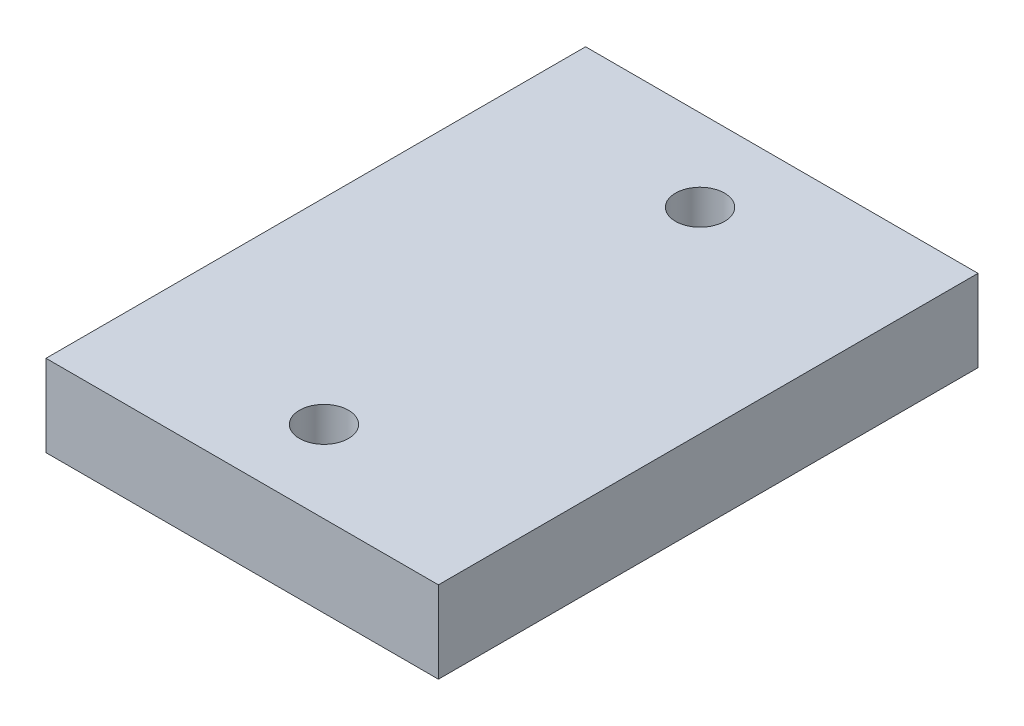
ISO-10303-21;
HEADER;
FILE_DESCRIPTION(('STEP AP214'),'2;1');
FILE_NAME('part.step','',(''),(''),'','','');
FILE_SCHEMA(('AUTOMOTIVE_DESIGN { 1 0 10303 214 1 1 1 1 }'));
ENDSEC;
DATA;
#1=APPLICATION_CONTEXT('core data for automotive mechanical design processes');
#2=APPLICATION_PROTOCOL_DEFINITION('international standard','automotive_design',2000,#1);
#3=PRODUCT_CONTEXT('',#1,'mechanical');
#4=PRODUCT('Part','Part','',(#3));
#5=PRODUCT_RELATED_PRODUCT_CATEGORY('part','',(#4));
#6=PRODUCT_DEFINITION_FORMATION('','',#4);
#7=PRODUCT_DEFINITION_CONTEXT('part definition',#1,'design');
#8=PRODUCT_DEFINITION('design','',#6,#7);
#9=PRODUCT_DEFINITION_SHAPE('','',#8);
#10=(LENGTH_UNIT() NAMED_UNIT(*) SI_UNIT(.MILLI.,.METRE.));
#11=(NAMED_UNIT(*) PLANE_ANGLE_UNIT() SI_UNIT($,.RADIAN.));
#12=(NAMED_UNIT(*) SI_UNIT($,.STERADIAN.) SOLID_ANGLE_UNIT());
#13=UNCERTAINTY_MEASURE_WITH_UNIT(LENGTH_MEASURE(1.E-05),#10,'distance_accuracy_value','');
#14=(GEOMETRIC_REPRESENTATION_CONTEXT(3) GLOBAL_UNCERTAINTY_ASSIGNED_CONTEXT((#13)) GLOBAL_UNIT_ASSIGNED_CONTEXT((#10,
#11,#12)) REPRESENTATION_CONTEXT('',''));
#15=CARTESIAN_POINT('',(0.,0.,0.));
#16=DIRECTION('',(0.,0.,1.));
#17=DIRECTION('',(1.,0.,0.));
#18=AXIS2_PLACEMENT_3D('',#15,#16,#17);
#19=CARTESIAN_POINT('',(0.,5.,0.));
#20=DIRECTION('',(0.,1.,0.));
#21=DIRECTION('',(0.,0.,1.));
#22=AXIS2_PLACEMENT_3D('',#19,#20,#21);
#23=PLANE('',#22);
#24=CARTESIAN_POINT('',(0.,5.,-11.5));
#25=DIRECTION('',(0.,1.,0.));
#26=DIRECTION('',(0.,0.,1.));
#27=AXIS2_PLACEMENT_3D('',#24,#25,#26);
#28=CIRCLE('',#27,1.5);
#29=CARTESIAN_POINT('',(0.,5.,-10.));
#30=VERTEX_POINT('',#29);
#31=EDGE_CURVE('E112',#30,#30,#28,.T.);
#32=ORIENTED_EDGE('',*,*,#31,.F.);
#33=EDGE_LOOP('',(#32));
#34=FACE_BOUND('',#33,.T.);
#35=DIRECTION('',(0.,0.,-1.));
#36=VECTOR('',#35,1.);
#37=CARTESIAN_POINT('',(12.,5.,-16.5));
#38=LINE('',#37,#36);
#39=CARTESIAN_POINT('',(12.,5.,16.5));
#40=VERTEX_POINT('',#39);
#41=CARTESIAN_POINT('',(12.,5.,-16.5));
#42=VERTEX_POINT('',#41);
#43=EDGE_CURVE('E92',#40,#42,#38,.T.);
#44=ORIENTED_EDGE('',*,*,#43,.T.);
#45=DIRECTION('',(-1.,0.,0.));
#46=VECTOR('',#45,1.);
#47=CARTESIAN_POINT('',(-12.,5.,-16.5));
#48=LINE('',#47,#46);
#49=CARTESIAN_POINT('',(-12.,5.,-16.5));
#50=VERTEX_POINT('',#49);
#51=EDGE_CURVE('E87',#42,#50,#48,.T.);
#52=ORIENTED_EDGE('',*,*,#51,.T.);
#53=DIRECTION('',(0.,0.,1.));
#54=VECTOR('',#53,1.);
#55=CARTESIAN_POINT('',(-12.,5.,-16.5));
#56=LINE('',#55,#54);
#57=CARTESIAN_POINT('',(-12.,5.,16.5));
#58=VERTEX_POINT('',#57);
#59=EDGE_CURVE('E90',#50,#58,#56,.T.);
#60=ORIENTED_EDGE('',*,*,#59,.T.);
#61=DIRECTION('',(1.,0.,0.));
#62=VECTOR('',#61,1.);
#63=CARTESIAN_POINT('',(-12.,5.,16.5));
#64=LINE('',#63,#62);
#65=EDGE_CURVE('E57',#58,#40,#64,.T.);
#66=ORIENTED_EDGE('',*,*,#65,.T.);
#67=EDGE_LOOP('',(#44,#52,#60,#66));
#68=FACE_BOUND('',#67,.T.);
#69=CARTESIAN_POINT('',(0.,5.,11.5));
#70=DIRECTION('',(0.,1.,0.));
#71=DIRECTION('',(0.,0.,1.));
#72=AXIS2_PLACEMENT_3D('',#69,#70,#71);
#73=CIRCLE('',#72,1.5);
#74=CARTESIAN_POINT('',(0.,5.,13.));
#75=VERTEX_POINT('',#74);
#76=EDGE_CURVE('E134',#75,#75,#73,.T.);
#77=ORIENTED_EDGE('',*,*,#76,.F.);
#78=EDGE_LOOP('',(#77));
#79=FACE_BOUND('',#78,.T.);
#80=ADVANCED_FACE('F39',(#34,#68,#79),#23,.T.);
#81=CARTESIAN_POINT('',(0.,0.,0.));
#82=DIRECTION('',(0.,1.,0.));
#83=DIRECTION('',(0.,0.,1.));
#84=AXIS2_PLACEMENT_3D('',#81,#82,#83);
#85=PLANE('',#84);
#86=DIRECTION('',(0.,0.,-1.));
#87=VECTOR('',#86,1.);
#88=CARTESIAN_POINT('',(12.,0.,-16.5));
#89=LINE('',#88,#87);
#90=CARTESIAN_POINT('',(12.,0.,16.5));
#91=VERTEX_POINT('',#90);
#92=CARTESIAN_POINT('',(12.,0.,-16.5));
#93=VERTEX_POINT('',#92);
#94=EDGE_CURVE('E108',#91,#93,#89,.T.);
#95=ORIENTED_EDGE('',*,*,#94,.F.);
#96=DIRECTION('',(1.,0.,0.));
#97=VECTOR('',#96,1.);
#98=CARTESIAN_POINT('',(-12.,0.,16.5));
#99=LINE('',#98,#97);
#100=CARTESIAN_POINT('',(-12.,0.,16.5));
#101=VERTEX_POINT('',#100);
#102=EDGE_CURVE('E80',#101,#91,#99,.T.);
#103=ORIENTED_EDGE('',*,*,#102,.F.);
#104=DIRECTION('',(0.,0.,1.));
#105=VECTOR('',#104,1.);
#106=CARTESIAN_POINT('',(-12.,0.,-16.5));
#107=LINE('',#106,#105);
#108=CARTESIAN_POINT('',(-12.,0.,-16.5));
#109=VERTEX_POINT('',#108);
#110=EDGE_CURVE('E74',#109,#101,#107,.T.);
#111=ORIENTED_EDGE('',*,*,#110,.F.);
#112=DIRECTION('',(-1.,0.,0.));
#113=VECTOR('',#112,1.);
#114=CARTESIAN_POINT('',(-12.,0.,-16.5));
#115=LINE('',#114,#113);
#116=EDGE_CURVE('E97',#93,#109,#115,.T.);
#117=ORIENTED_EDGE('',*,*,#116,.F.);
#118=EDGE_LOOP('',(#95,#103,#111,#117));
#119=FACE_BOUND('',#118,.T.);
#120=CARTESIAN_POINT('',(0.,0.,-11.5));
#121=DIRECTION('',(0.,1.,0.));
#122=DIRECTION('',(0.,0.,1.));
#123=AXIS2_PLACEMENT_3D('',#120,#121,#122);
#124=CIRCLE('',#123,1.5);
#125=CARTESIAN_POINT('',(0.,0.,-10.));
#126=VERTEX_POINT('',#125);
#127=EDGE_CURVE('E130',#126,#126,#124,.T.);
#128=ORIENTED_EDGE('',*,*,#127,.T.);
#129=EDGE_LOOP('',(#128));
#130=FACE_BOUND('',#129,.T.);
#131=CARTESIAN_POINT('',(0.,0.,11.5));
#132=DIRECTION('',(0.,1.,0.));
#133=DIRECTION('',(0.,0.,1.));
#134=AXIS2_PLACEMENT_3D('',#131,#132,#133);
#135=CIRCLE('',#134,1.5);
#136=CARTESIAN_POINT('',(0.,0.,13.));
#137=VERTEX_POINT('',#136);
#138=EDGE_CURVE('E138',#137,#137,#135,.T.);
#139=ORIENTED_EDGE('',*,*,#138,.T.);
#140=EDGE_LOOP('',(#139));
#141=FACE_BOUND('',#140,.T.);
#142=ADVANCED_FACE('F125',(#119,#130,#141),#85,.F.);
#143=CARTESIAN_POINT('',(12.,5.,-16.5));
#144=DIRECTION('',(-1.,0.,0.));
#145=DIRECTION('',(0.,0.,1.));
#146=AXIS2_PLACEMENT_3D('',#143,#144,#145);
#147=PLANE('',#146);
#148=ORIENTED_EDGE('',*,*,#94,.T.);
#149=DIRECTION('',(0.,-1.,0.));
#150=VECTOR('',#149,1.);
#151=CARTESIAN_POINT('',(12.,5.,-16.5));
#152=LINE('',#151,#150);
#153=EDGE_CURVE('E11',#42,#93,#152,.T.);
#154=ORIENTED_EDGE('',*,*,#153,.F.);
#155=ORIENTED_EDGE('',*,*,#43,.F.);
#156=DIRECTION('',(0.,-1.,0.));
#157=VECTOR('',#156,1.);
#158=CARTESIAN_POINT('',(12.,5.,16.5));
#159=LINE('',#158,#157);
#160=EDGE_CURVE('E104',#40,#91,#159,.T.);
#161=ORIENTED_EDGE('',*,*,#160,.T.);
#162=EDGE_LOOP('',(#148,#154,#155,#161));
#163=FACE_BOUND('',#162,.T.);
#164=ADVANCED_FACE('F41',(#163),#147,.F.);
#165=CARTESIAN_POINT('',(-12.,5.,-16.5));
#166=DIRECTION('',(0.,0.,1.));
#167=DIRECTION('',(1.,0.,0.));
#168=AXIS2_PLACEMENT_3D('',#165,#166,#167);
#169=PLANE('',#168);
#170=ORIENTED_EDGE('',*,*,#116,.T.);
#171=DIRECTION('',(0.,-1.,0.));
#172=VECTOR('',#171,1.);
#173=CARTESIAN_POINT('',(-12.,5.,-16.5));
#174=LINE('',#173,#172);
#175=EDGE_CURVE('E49',#50,#109,#174,.T.);
#176=ORIENTED_EDGE('',*,*,#175,.F.);
#177=ORIENTED_EDGE('',*,*,#51,.F.);
#178=ORIENTED_EDGE('',*,*,#153,.T.);
#179=EDGE_LOOP('',(#170,#176,#177,#178));
#180=FACE_BOUND('',#179,.T.);
#181=ADVANCED_FACE('F96',(#180),#169,.F.);
#182=CARTESIAN_POINT('',(-12.,5.,-16.5));
#183=DIRECTION('',(1.,0.,0.));
#184=DIRECTION('',(0.,0.,-1.));
#185=AXIS2_PLACEMENT_3D('',#182,#183,#184);
#186=PLANE('',#185);
#187=ORIENTED_EDGE('',*,*,#110,.T.);
#188=DIRECTION('',(0.,-1.,0.));
#189=VECTOR('',#188,1.);
#190=CARTESIAN_POINT('',(-12.,5.,16.5));
#191=LINE('',#190,#189);
#192=EDGE_CURVE('E99',#58,#101,#191,.T.);
#193=ORIENTED_EDGE('',*,*,#192,.F.);
#194=ORIENTED_EDGE('',*,*,#59,.F.);
#195=ORIENTED_EDGE('',*,*,#175,.T.);
#196=EDGE_LOOP('',(#187,#193,#194,#195));
#197=FACE_BOUND('',#196,.T.);
#198=ADVANCED_FACE('F100',(#197),#186,.F.);
#199=CARTESIAN_POINT('',(-12.,5.,16.5));
#200=DIRECTION('',(0.,0.,-1.));
#201=DIRECTION('',(-1.,0.,0.));
#202=AXIS2_PLACEMENT_3D('',#199,#200,#201);
#203=PLANE('',#202);
#204=ORIENTED_EDGE('',*,*,#102,.T.);
#205=ORIENTED_EDGE('',*,*,#160,.F.);
#206=ORIENTED_EDGE('',*,*,#65,.F.);
#207=ORIENTED_EDGE('',*,*,#192,.T.);
#208=EDGE_LOOP('',(#204,#205,#206,#207));
#209=FACE_BOUND('',#208,.T.);
#210=ADVANCED_FACE('F122',(#209),#203,.F.);
#211=CARTESIAN_POINT('',(0.,5.,-11.5));
#212=DIRECTION('',(0.,-1.,0.));
#213=DIRECTION('',(0.,0.,-1.));
#214=AXIS2_PLACEMENT_3D('',#211,#212,#213);
#215=CYLINDRICAL_SURFACE('',#214,1.5);
#216=ORIENTED_EDGE('',*,*,#31,.T.);
#217=EDGE_LOOP('',(#216));
#218=FACE_BOUND('',#217,.T.);
#219=ORIENTED_EDGE('',*,*,#127,.F.);
#220=EDGE_LOOP('',(#219));
#221=FACE_BOUND('',#220,.T.);
#222=ADVANCED_FACE('F157',(#218,#221),#215,.F.);
#223=CARTESIAN_POINT('',(0.,5.,11.5));
#224=DIRECTION('',(0.,-1.,0.));
#225=DIRECTION('',(0.,0.,-1.));
#226=AXIS2_PLACEMENT_3D('',#223,#224,#225);
#227=CYLINDRICAL_SURFACE('',#226,1.5);
#228=ORIENTED_EDGE('',*,*,#76,.T.);
#229=EDGE_LOOP('',(#228));
#230=FACE_BOUND('',#229,.T.);
#231=ORIENTED_EDGE('',*,*,#138,.F.);
#232=EDGE_LOOP('',(#231));
#233=FACE_BOUND('',#232,.T.);
#234=ADVANCED_FACE('F146',(#230,#233),#227,.F.);
#235=CLOSED_SHELL('',(#80,#142,#164,#181,#198,#210,#222,#234));
#236=MANIFOLD_SOLID_BREP('B2',#235);
#237=ADVANCED_BREP_SHAPE_REPRESENTATION('',(#18,#236),#14);
#238=SHAPE_DEFINITION_REPRESENTATION(#9,#237);
ENDSEC;
END-ISO-10303-21;
